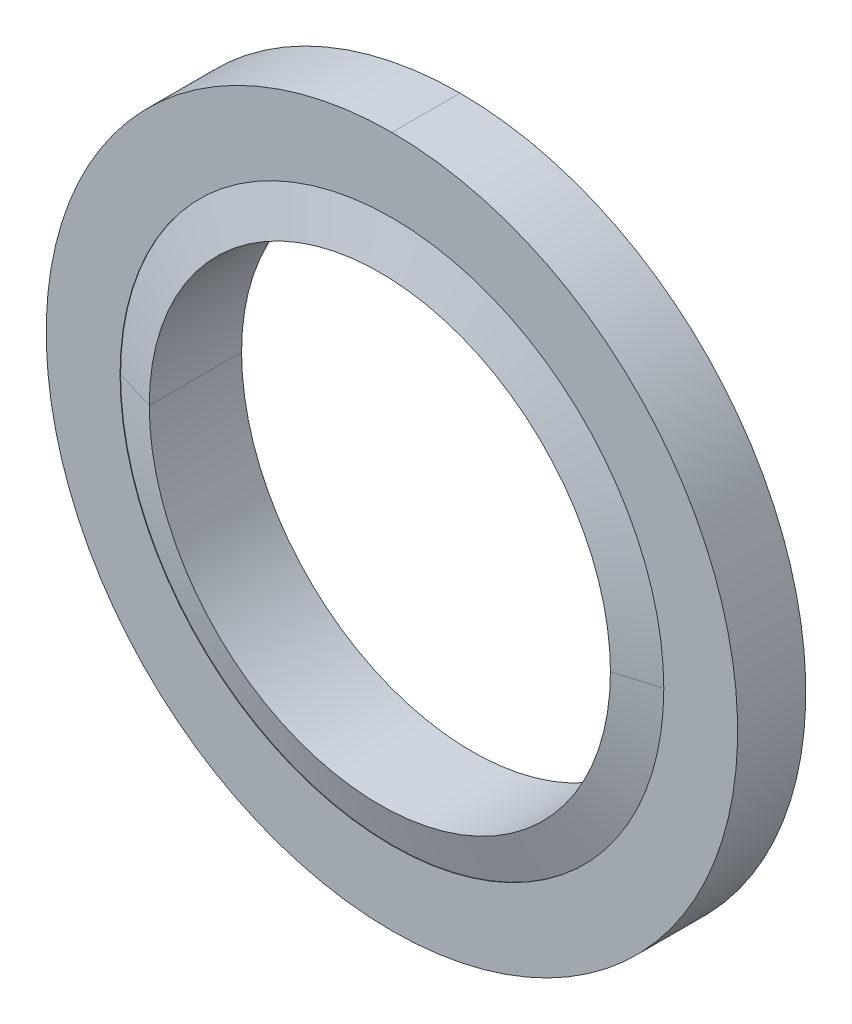
ISO-10303-21;
HEADER;
FILE_DESCRIPTION(('STEP AP214'),'2;1');
FILE_NAME('part.step','',(''),(''),'','','');
FILE_SCHEMA(('AUTOMOTIVE_DESIGN { 1 0 10303 214 1 1 1 1 }'));
ENDSEC;
DATA;
#1=APPLICATION_CONTEXT('core data for automotive mechanical design processes');
#2=APPLICATION_PROTOCOL_DEFINITION('international standard','automotive_design',2000,#1);
#3=PRODUCT_CONTEXT('',#1,'mechanical');
#4=PRODUCT('Part','Part','',(#3));
#5=PRODUCT_RELATED_PRODUCT_CATEGORY('part','',(#4));
#6=PRODUCT_DEFINITION_FORMATION('','',#4);
#7=PRODUCT_DEFINITION_CONTEXT('part definition',#1,'design');
#8=PRODUCT_DEFINITION('design','',#6,#7);
#9=PRODUCT_DEFINITION_SHAPE('','',#8);
#10=(LENGTH_UNIT() NAMED_UNIT(*) SI_UNIT(.MILLI.,.METRE.));
#11=(NAMED_UNIT(*) PLANE_ANGLE_UNIT() SI_UNIT($,.RADIAN.));
#12=(NAMED_UNIT(*) SI_UNIT($,.STERADIAN.) SOLID_ANGLE_UNIT());
#13=UNCERTAINTY_MEASURE_WITH_UNIT(LENGTH_MEASURE(1.E-05),#10,'distance_accuracy_value','');
#14=(GEOMETRIC_REPRESENTATION_CONTEXT(3) GLOBAL_UNCERTAINTY_ASSIGNED_CONTEXT((#13)) GLOBAL_UNIT_ASSIGNED_CONTEXT((#10,
#11,#12)) REPRESENTATION_CONTEXT('',''));
#15=CARTESIAN_POINT('',(0.,0.,0.));
#16=DIRECTION('',(0.,0.,1.));
#17=DIRECTION('',(1.,0.,0.));
#18=AXIS2_PLACEMENT_3D('',#15,#16,#17);
#19=CARTESIAN_POINT('',(0.,0.,1.1165));
#20=DIRECTION('',(0.,0.,-1.));
#21=DIRECTION('',(0.,1.,0.));
#22=AXIS2_PLACEMENT_3D('',#19,#20,#21);
#23=CYLINDRICAL_SURFACE('',#22,8.1);
#24=CARTESIAN_POINT('',(0.,0.,1.015));
#25=DIRECTION('',(0.,0.,1.));
#26=DIRECTION('',(0.,1.,0.));
#27=AXIS2_PLACEMENT_3D('',#24,#25,#26);
#28=CIRCLE('',#27,8.1);
#29=CARTESIAN_POINT('',(0.,8.1,1.015));
#30=VERTEX_POINT('',#29);
#31=CARTESIAN_POINT('',(0.,-8.1,1.015));
#32=VERTEX_POINT('',#31);
#33=EDGE_CURVE('P0_E107',#30,#32,#28,.T.);
#34=ORIENTED_EDGE('',*,*,#33,.T.);
#35=DIRECTION('',(0.,0.,1.));
#36=VECTOR('',#35,1.);
#37=CARTESIAN_POINT('',(0.,-8.1,-1.015));
#38=LINE('',#37,#36);
#39=CARTESIAN_POINT('',(0.,-8.1,-1.015));
#40=VERTEX_POINT('',#39);
#41=EDGE_CURVE('P0_E25',#40,#32,#38,.T.);
#42=ORIENTED_EDGE('',*,*,#41,.F.);
#43=CARTESIAN_POINT('',(0.,0.,-1.015));
#44=DIRECTION('',(0.,0.,1.));
#45=DIRECTION('',(0.,1.,0.));
#46=AXIS2_PLACEMENT_3D('',#43,#44,#45);
#47=CIRCLE('',#46,8.1);
#48=CARTESIAN_POINT('',(0.,8.1,-1.015));
#49=VERTEX_POINT('',#48);
#50=EDGE_CURVE('P0_E108',#49,#40,#47,.T.);
#51=ORIENTED_EDGE('',*,*,#50,.F.);
#52=DIRECTION('',(0.,0.,1.));
#53=VECTOR('',#52,1.);
#54=CARTESIAN_POINT('',(0.,8.1,-1.015));
#55=LINE('',#54,#53);
#56=EDGE_CURVE('P0_E10',#49,#30,#55,.T.);
#57=ORIENTED_EDGE('',*,*,#56,.T.);
#58=EDGE_LOOP('',(#34,#42,#51,#57));
#59=FACE_BOUND('',#58,.T.);
#60=ADVANCED_FACE('P0_F15',(#59),#23,.F.);
#61=CARTESIAN_POINT('',(0.,0.,1.1165));
#62=DIRECTION('',(0.,0.,-1.));
#63=DIRECTION('',(0.,1.,0.));
#64=AXIS2_PLACEMENT_3D('',#61,#62,#63);
#65=CYLINDRICAL_SURFACE('',#64,8.1);
#66=CARTESIAN_POINT('',(0.,0.,-1.015));
#67=DIRECTION('',(0.,0.,-1.));
#68=DIRECTION('',(0.,1.,0.));
#69=AXIS2_PLACEMENT_3D('',#66,#67,#68);
#70=CIRCLE('',#69,8.1);
#71=EDGE_CURVE('P0_E93',#49,#40,#70,.T.);
#72=ORIENTED_EDGE('',*,*,#71,.T.);
#73=ORIENTED_EDGE('',*,*,#41,.T.);
#74=CARTESIAN_POINT('',(0.,0.,1.015));
#75=DIRECTION('',(0.,0.,-1.));
#76=DIRECTION('',(0.,1.,0.));
#77=AXIS2_PLACEMENT_3D('',#74,#75,#76);
#78=CIRCLE('',#77,8.1);
#79=EDGE_CURVE('P0_E105',#30,#32,#78,.T.);
#80=ORIENTED_EDGE('',*,*,#79,.F.);
#81=ORIENTED_EDGE('',*,*,#56,.F.);
#82=EDGE_LOOP('',(#72,#73,#80,#81));
#83=FACE_BOUND('',#82,.T.);
#84=ADVANCED_FACE('P0_F17',(#83),#65,.F.);
#85=CARTESIAN_POINT('',(0.,0.,1.015));
#86=DIRECTION('',(0.,0.,-1.));
#87=DIRECTION('',(0.,-1.,0.));
#88=AXIS2_PLACEMENT_3D('',#85,#86,#87);
#89=PLANE('',#88);
#90=ORIENTED_EDGE('',*,*,#33,.F.);
#91=ORIENTED_EDGE('',*,*,#79,.T.);
#92=EDGE_LOOP('',(#90,#91));
#93=FACE_BOUND('',#92,.T.);
#94=CARTESIAN_POINT('',(0.,0.,1.015));
#95=DIRECTION('',(0.,0.,-1.));
#96=DIRECTION('',(0.,1.,0.));
#97=AXIS2_PLACEMENT_3D('',#94,#95,#96);
#98=CIRCLE('',#97,10.3);
#99=CARTESIAN_POINT('',(0.,10.3,1.015));
#100=VERTEX_POINT('',#99);
#101=CARTESIAN_POINT('',(0.,-10.3,1.015));
#102=VERTEX_POINT('',#101);
#103=EDGE_CURVE('P0_E84',#100,#102,#98,.T.);
#104=ORIENTED_EDGE('',*,*,#103,.F.);
#105=CARTESIAN_POINT('',(0.,0.,1.015));
#106=DIRECTION('',(0.,0.,1.));
#107=DIRECTION('',(0.,1.,0.));
#108=AXIS2_PLACEMENT_3D('',#105,#106,#107);
#109=CIRCLE('',#108,10.3);
#110=EDGE_CURVE('P0_E64',#100,#102,#109,.T.);
#111=ORIENTED_EDGE('',*,*,#110,.T.);
#112=EDGE_LOOP('',(#104,#111));
#113=FACE_BOUND('',#112,.T.);
#114=ADVANCED_FACE('P0_F128',(#93,#113),#89,.F.);
#115=CARTESIAN_POINT('',(0.,0.,1.1165));
#116=DIRECTION('',(0.,0.,-1.));
#117=DIRECTION('',(0.,1.,0.));
#118=AXIS2_PLACEMENT_3D('',#115,#116,#117);
#119=CYLINDRICAL_SURFACE('',#118,10.3);
#120=CARTESIAN_POINT('',(0.,0.,-1.015));
#121=DIRECTION('',(0.,0.,1.));
#122=DIRECTION('',(0.,1.,0.));
#123=AXIS2_PLACEMENT_3D('',#120,#121,#122);
#124=CIRCLE('',#123,10.3);
#125=CARTESIAN_POINT('',(0.,10.3,-1.015));
#126=VERTEX_POINT('',#125);
#127=CARTESIAN_POINT('',(0.,-10.3,-1.015));
#128=VERTEX_POINT('',#127);
#129=EDGE_CURVE('P0_E91',#126,#128,#124,.T.);
#130=ORIENTED_EDGE('',*,*,#129,.T.);
#131=DIRECTION('',(0.,0.,-1.));
#132=VECTOR('',#131,1.);
#133=CARTESIAN_POINT('',(0.,-10.3,1.015));
#134=LINE('',#133,#132);
#135=EDGE_CURVE('P0_E79',#102,#128,#134,.T.);
#136=ORIENTED_EDGE('',*,*,#135,.F.);
#137=ORIENTED_EDGE('',*,*,#110,.F.);
#138=DIRECTION('',(0.,0.,-1.));
#139=VECTOR('',#138,1.);
#140=CARTESIAN_POINT('',(0.,10.3,1.015));
#141=LINE('',#140,#139);
#142=EDGE_CURVE('P0_E87',#100,#126,#141,.T.);
#143=ORIENTED_EDGE('',*,*,#142,.T.);
#144=EDGE_LOOP('',(#130,#136,#137,#143));
#145=FACE_BOUND('',#144,.T.);
#146=ADVANCED_FACE('P0_F94',(#145),#119,.T.);
#147=CARTESIAN_POINT('',(0.,0.,1.1165));
#148=DIRECTION('',(0.,0.,-1.));
#149=DIRECTION('',(0.,1.,0.));
#150=AXIS2_PLACEMENT_3D('',#147,#148,#149);
#151=CYLINDRICAL_SURFACE('',#150,10.3);
#152=ORIENTED_EDGE('',*,*,#103,.T.);
#153=ORIENTED_EDGE('',*,*,#135,.T.);
#154=CARTESIAN_POINT('',(0.,0.,-1.015));
#155=DIRECTION('',(0.,0.,-1.));
#156=DIRECTION('',(0.,1.,0.));
#157=AXIS2_PLACEMENT_3D('',#154,#155,#156);
#158=CIRCLE('',#157,10.3);
#159=EDGE_CURVE('P0_E19',#126,#128,#158,.T.);
#160=ORIENTED_EDGE('',*,*,#159,.F.);
#161=ORIENTED_EDGE('',*,*,#142,.F.);
#162=EDGE_LOOP('',(#152,#153,#160,#161));
#163=FACE_BOUND('',#162,.T.);
#164=ADVANCED_FACE('P0_F81',(#163),#151,.T.);
#165=CARTESIAN_POINT('',(0.,0.,-1.015));
#166=DIRECTION('',(0.,0.,-1.));
#167=DIRECTION('',(0.,-1.,0.));
#168=AXIS2_PLACEMENT_3D('',#165,#166,#167);
#169=PLANE('',#168);
#170=ORIENTED_EDGE('',*,*,#71,.F.);
#171=ORIENTED_EDGE('',*,*,#50,.T.);
#172=EDGE_LOOP('',(#170,#171));
#173=FACE_BOUND('',#172,.T.);
#174=ORIENTED_EDGE('',*,*,#129,.F.);
#175=ORIENTED_EDGE('',*,*,#159,.T.);
#176=EDGE_LOOP('',(#174,#175));
#177=FACE_BOUND('',#176,.T.);
#178=ADVANCED_FACE('P0_F90',(#173,#177),#169,.T.);
#179=CLOSED_SHELL('',(#60,#84,#114,#146,#164,#178));
#180=MANIFOLD_SOLID_BREP('P0_B1',#179);
#181=CARTESIAN_POINT('',(0.,0.,-1.5125));
#182=DIRECTION('',(0.,0.,1.));
#183=DIRECTION('',(-1.,0.,0.));
#184=AXIS2_PLACEMENT_3D('',#181,#182,#183);
#185=CYLINDRICAL_SURFACE('',#184,6.87);
#186=CARTESIAN_POINT('',(0.,0.,1.375));
#187=DIRECTION('',(0.,0.,1.));
#188=DIRECTION('',(-1.,0.,0.));
#189=AXIS2_PLACEMENT_3D('',#186,#187,#188);
#190=CIRCLE('',#189,6.87);
#191=CARTESIAN_POINT('',(-6.87,0.,1.375));
#192=VERTEX_POINT('',#191);
#193=CARTESIAN_POINT('',(6.87,0.,1.375));
#194=VERTEX_POINT('',#193);
#195=EDGE_CURVE('P1_E116',#192,#194,#190,.T.);
#196=ORIENTED_EDGE('',*,*,#195,.T.);
#197=DIRECTION('',(0.,0.,-1.));
#198=VECTOR('',#197,1.);
#199=CARTESIAN_POINT('',(6.87,0.,1.375));
#200=LINE('',#199,#198);
#201=CARTESIAN_POINT('',(6.87,0.,-1.375));
#202=VERTEX_POINT('',#201);
#203=EDGE_CURVE('P1_E26',#194,#202,#200,.T.);
#204=ORIENTED_EDGE('',*,*,#203,.T.);
#205=CARTESIAN_POINT('',(0.,0.,-1.375));
#206=DIRECTION('',(0.,0.,1.));
#207=DIRECTION('',(-1.,0.,0.));
#208=AXIS2_PLACEMENT_3D('',#205,#206,#207);
#209=CIRCLE('',#208,6.87);
#210=CARTESIAN_POINT('',(-6.87,0.,-1.375));
#211=VERTEX_POINT('',#210);
#212=EDGE_CURVE('P1_E72',#211,#202,#209,.T.);
#213=ORIENTED_EDGE('',*,*,#212,.F.);
#214=DIRECTION('',(0.,0.,-1.));
#215=VECTOR('',#214,1.);
#216=CARTESIAN_POINT('',(-6.87,0.,1.375));
#217=LINE('',#216,#215);
#218=EDGE_CURVE('P1_E10',#192,#211,#217,.T.);
#219=ORIENTED_EDGE('',*,*,#218,.F.);
#220=EDGE_LOOP('',(#196,#204,#213,#219));
#221=FACE_BOUND('',#220,.T.);
#222=ADVANCED_FACE('P1_F15',(#221),#185,.F.);
#223=CARTESIAN_POINT('',(0.,0.,-1.5125));
#224=DIRECTION('',(0.,0.,1.));
#225=DIRECTION('',(-1.,0.,0.));
#226=AXIS2_PLACEMENT_3D('',#223,#224,#225);
#227=CYLINDRICAL_SURFACE('',#226,6.87);
#228=CARTESIAN_POINT('',(0.,0.,-1.375));
#229=DIRECTION('',(0.,0.,-1.));
#230=DIRECTION('',(-1.,0.,0.));
#231=AXIS2_PLACEMENT_3D('',#228,#229,#230);
#232=CIRCLE('',#231,6.87);
#233=EDGE_CURVE('P1_E106',#211,#202,#232,.T.);
#234=ORIENTED_EDGE('',*,*,#233,.T.);
#235=ORIENTED_EDGE('',*,*,#203,.F.);
#236=CARTESIAN_POINT('',(0.,0.,1.375));
#237=DIRECTION('',(0.,0.,-1.));
#238=DIRECTION('',(-1.,0.,0.));
#239=AXIS2_PLACEMENT_3D('',#236,#237,#238);
#240=CIRCLE('',#239,6.87);
#241=EDGE_CURVE('P1_E103',#192,#194,#240,.T.);
#242=ORIENTED_EDGE('',*,*,#241,.F.);
#243=ORIENTED_EDGE('',*,*,#218,.T.);
#244=EDGE_LOOP('',(#234,#235,#242,#243));
#245=FACE_BOUND('',#244,.T.);
#246=ADVANCED_FACE('P1_F188',(#245),#227,.F.);
#247=CARTESIAN_POINT('',(0.,0.,-1.1875));
#248=DIRECTION('',(0.,0.,1.));
#249=DIRECTION('',(-1.,0.,0.));
#250=AXIS2_PLACEMENT_3D('',#247,#248,#249);
#251=CONICAL_SURFACE('',#250,7.485,1.27487028833036);
#252=CARTESIAN_POINT('',(0.,0.,-1.));
#253=DIRECTION('',(0.,0.,-1.));
#254=DIRECTION('',(-1.,0.,0.));
#255=AXIS2_PLACEMENT_3D('',#252,#253,#254);
#256=CIRCLE('',#255,8.1);
#257=CARTESIAN_POINT('',(-8.1,0.,-1.));
#258=VERTEX_POINT('',#257);
#259=CARTESIAN_POINT('',(8.1,0.,-1.));
#260=VERTEX_POINT('',#259);
#261=EDGE_CURVE('P1_E87',#258,#260,#256,.T.);
#262=ORIENTED_EDGE('',*,*,#261,.T.);
#263=DIRECTION('',(0.956532495823703,0.,0.291625760921901));
#264=VECTOR('',#263,1.);
#265=CARTESIAN_POINT('',(6.87,0.,-1.375));
#266=LINE('',#265,#264);
#267=EDGE_CURVE('P1_E67',#202,#260,#266,.T.);
#268=ORIENTED_EDGE('',*,*,#267,.F.);
#269=ORIENTED_EDGE('',*,*,#233,.F.);
#270=DIRECTION('',(-0.956532495823703,0.,0.291625760921901));
#271=VECTOR('',#270,1.);
#272=CARTESIAN_POINT('',(-6.87,0.,-1.375));
#273=LINE('',#272,#271);
#274=EDGE_CURVE('P1_E77',#211,#258,#273,.T.);
#275=ORIENTED_EDGE('',*,*,#274,.T.);
#276=EDGE_LOOP('',(#262,#268,#269,#275));
#277=FACE_BOUND('',#276,.T.);
#278=ADVANCED_FACE('P1_F88',(#277),#251,.T.);
#279=CARTESIAN_POINT('',(0.,0.,-1.1875));
#280=DIRECTION('',(0.,0.,1.));
#281=DIRECTION('',(-1.,0.,0.));
#282=AXIS2_PLACEMENT_3D('',#279,#280,#281);
#283=CONICAL_SURFACE('',#282,7.485,1.27487028833036);
#284=ORIENTED_EDGE('',*,*,#212,.T.);
#285=ORIENTED_EDGE('',*,*,#267,.T.);
#286=CARTESIAN_POINT('',(0.,0.,-1.));
#287=DIRECTION('',(0.,0.,1.));
#288=DIRECTION('',(-1.,0.,0.));
#289=AXIS2_PLACEMENT_3D('',#286,#287,#288);
#290=CIRCLE('',#289,8.1);
#291=EDGE_CURVE('P1_E19',#258,#260,#290,.T.);
#292=ORIENTED_EDGE('',*,*,#291,.F.);
#293=ORIENTED_EDGE('',*,*,#274,.F.);
#294=EDGE_LOOP('',(#284,#285,#292,#293));
#295=FACE_BOUND('',#294,.T.);
#296=ADVANCED_FACE('P1_F69',(#295),#283,.T.);
#297=CARTESIAN_POINT('',(0.,0.,-1.5125));
#298=DIRECTION('',(0.,0.,1.));
#299=DIRECTION('',(-1.,0.,0.));
#300=AXIS2_PLACEMENT_3D('',#297,#298,#299);
#301=CYLINDRICAL_SURFACE('',#300,8.1);
#302=ORIENTED_EDGE('',*,*,#291,.T.);
#303=DIRECTION('',(0.,0.,1.));
#304=VECTOR('',#303,1.);
#305=CARTESIAN_POINT('',(8.1,0.,-1.));
#306=LINE('',#305,#304);
#307=CARTESIAN_POINT('',(8.1,0.,1.));
#308=VERTEX_POINT('',#307);
#309=EDGE_CURVE('P1_E82',#260,#308,#306,.T.);
#310=ORIENTED_EDGE('',*,*,#309,.T.);
#311=CARTESIAN_POINT('',(0.,0.,1.));
#312=DIRECTION('',(0.,0.,1.));
#313=DIRECTION('',(-1.,0.,0.));
#314=AXIS2_PLACEMENT_3D('',#311,#312,#313);
#315=CIRCLE('',#314,8.1);
#316=CARTESIAN_POINT('',(-8.1,0.,1.));
#317=VERTEX_POINT('',#316);
#318=EDGE_CURVE('P1_E117',#317,#308,#315,.T.);
#319=ORIENTED_EDGE('',*,*,#318,.F.);
#320=DIRECTION('',(0.,0.,1.));
#321=VECTOR('',#320,1.);
#322=CARTESIAN_POINT('',(-8.1,0.,-1.));
#323=LINE('',#322,#321);
#324=EDGE_CURVE('P1_E84',#258,#317,#323,.T.);
#325=ORIENTED_EDGE('',*,*,#324,.F.);
#326=EDGE_LOOP('',(#302,#310,#319,#325));
#327=FACE_BOUND('',#326,.T.);
#328=ADVANCED_FACE('P1_F17',(#327),#301,.T.);
#329=CARTESIAN_POINT('',(0.,0.,-1.5125));
#330=DIRECTION('',(0.,0.,1.));
#331=DIRECTION('',(-1.,0.,0.));
#332=AXIS2_PLACEMENT_3D('',#329,#330,#331);
#333=CYLINDRICAL_SURFACE('',#332,8.1);
#334=CARTESIAN_POINT('',(0.,0.,1.));
#335=DIRECTION('',(0.,0.,-1.));
#336=DIRECTION('',(-1.,0.,0.));
#337=AXIS2_PLACEMENT_3D('',#334,#335,#336);
#338=CIRCLE('',#337,8.1);
#339=EDGE_CURVE('P1_E94',#317,#308,#338,.T.);
#340=ORIENTED_EDGE('',*,*,#339,.T.);
#341=ORIENTED_EDGE('',*,*,#309,.F.);
#342=ORIENTED_EDGE('',*,*,#261,.F.);
#343=ORIENTED_EDGE('',*,*,#324,.T.);
#344=EDGE_LOOP('',(#340,#341,#342,#343));
#345=FACE_BOUND('',#344,.T.);
#346=ADVANCED_FACE('P1_F92',(#345),#333,.T.);
#347=CARTESIAN_POINT('',(0.,0.,1.1875));
#348=DIRECTION('',(0.,0.,-1.));
#349=DIRECTION('',(1.,0.,0.));
#350=AXIS2_PLACEMENT_3D('',#347,#348,#349);
#351=CONICAL_SURFACE('',#350,7.485,1.27487028833036);
#352=ORIENTED_EDGE('',*,*,#241,.T.);
#353=DIRECTION('',(-0.956532495823703,0.,0.291625760921901));
#354=VECTOR('',#353,1.);
#355=CARTESIAN_POINT('',(8.1,0.,1.));
#356=LINE('',#355,#354);
#357=EDGE_CURVE('P1_E112',#308,#194,#356,.T.);
#358=ORIENTED_EDGE('',*,*,#357,.F.);
#359=ORIENTED_EDGE('',*,*,#339,.F.);
#360=DIRECTION('',(0.956532495823703,0.,0.291625760921901));
#361=VECTOR('',#360,1.);
#362=CARTESIAN_POINT('',(-8.1,0.,1.));
#363=LINE('',#362,#361);
#364=EDGE_CURVE('P1_E123',#317,#192,#363,.T.);
#365=ORIENTED_EDGE('',*,*,#364,.T.);
#366=EDGE_LOOP('',(#352,#358,#359,#365));
#367=FACE_BOUND('',#366,.T.);
#368=ADVANCED_FACE('P1_F157',(#367),#351,.T.);
#369=CARTESIAN_POINT('',(0.,0.,1.1875));
#370=DIRECTION('',(0.,0.,-1.));
#371=DIRECTION('',(1.,0.,0.));
#372=AXIS2_PLACEMENT_3D('',#369,#370,#371);
#373=CONICAL_SURFACE('',#372,7.485,1.27487028833036);
#374=ORIENTED_EDGE('',*,*,#318,.T.);
#375=ORIENTED_EDGE('',*,*,#357,.T.);
#376=ORIENTED_EDGE('',*,*,#195,.F.);
#377=ORIENTED_EDGE('',*,*,#364,.F.);
#378=EDGE_LOOP('',(#374,#375,#376,#377));
#379=FACE_BOUND('',#378,.T.);
#380=ADVANCED_FACE('P1_F152',(#379),#373,.T.);
#381=CLOSED_SHELL('',(#222,#246,#278,#296,#328,#346,#368,#380));
#382=MANIFOLD_SOLID_BREP('P1_B1',#381);
#383=ADVANCED_BREP_SHAPE_REPRESENTATION('',(#18,#180,#382),#14);
#384=SHAPE_DEFINITION_REPRESENTATION(#9,#383);
ENDSEC;
END-ISO-10303-21;
